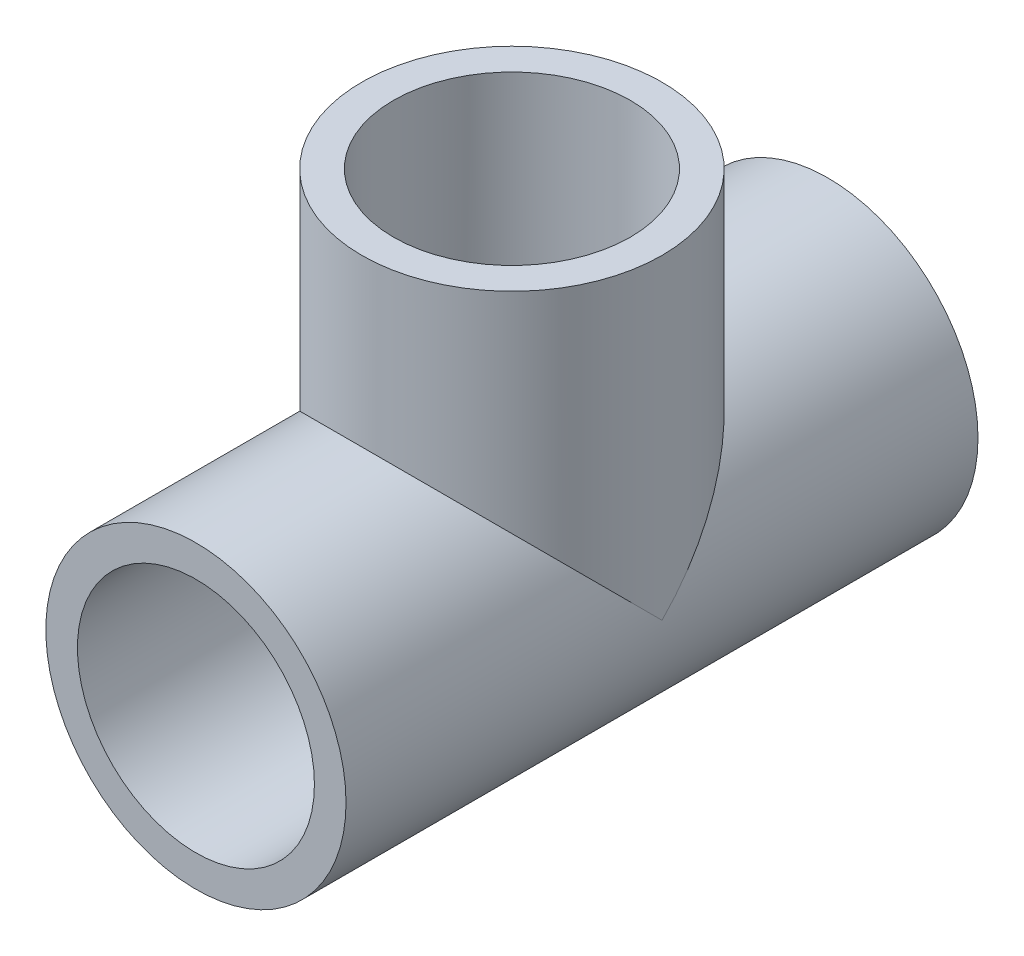
ISO-10303-21;
HEADER;
FILE_DESCRIPTION(('STEP AP214'),'2;1');
FILE_NAME('part.step','',(''),(''),'','','');
FILE_SCHEMA(('AUTOMOTIVE_DESIGN { 1 0 10303 214 1 1 1 1 }'));
ENDSEC;
DATA;
#1=APPLICATION_CONTEXT('core data for automotive mechanical design processes');
#2=APPLICATION_PROTOCOL_DEFINITION('international standard','automotive_design',2000,#1);
#3=PRODUCT_CONTEXT('',#1,'mechanical');
#4=PRODUCT('Part','Part','',(#3));
#5=PRODUCT_RELATED_PRODUCT_CATEGORY('part','',(#4));
#6=PRODUCT_DEFINITION_FORMATION('','',#4);
#7=PRODUCT_DEFINITION_CONTEXT('part definition',#1,'design');
#8=PRODUCT_DEFINITION('design','',#6,#7);
#9=PRODUCT_DEFINITION_SHAPE('','',#8);
#10=(LENGTH_UNIT() NAMED_UNIT(*) SI_UNIT(.MILLI.,.METRE.));
#11=(NAMED_UNIT(*) PLANE_ANGLE_UNIT() SI_UNIT($,.RADIAN.));
#12=(NAMED_UNIT(*) SI_UNIT($,.STERADIAN.) SOLID_ANGLE_UNIT());
#13=UNCERTAINTY_MEASURE_WITH_UNIT(LENGTH_MEASURE(1.E-05),#10,'distance_accuracy_value','');
#14=(GEOMETRIC_REPRESENTATION_CONTEXT(3) GLOBAL_UNCERTAINTY_ASSIGNED_CONTEXT((#13)) GLOBAL_UNIT_ASSIGNED_CONTEXT((#10,
#11,#12)) REPRESENTATION_CONTEXT('',''));
#15=CARTESIAN_POINT('',(0.,0.,0.));
#16=DIRECTION('',(0.,0.,1.));
#17=DIRECTION('',(1.,0.,0.));
#18=AXIS2_PLACEMENT_3D('',#15,#16,#17);
#19=CARTESIAN_POINT('',(0.,0.,101.6));
#20=DIRECTION('',(0.,0.,-1.));
#21=DIRECTION('',(-1.,0.,0.));
#22=AXIS2_PLACEMENT_3D('',#19,#20,#21);
#23=CYLINDRICAL_SURFACE('',#22,24.13);
#24=CARTESIAN_POINT('',(0.,0.,0.));
#25=DIRECTION('',(0.,0.,1.));
#26=DIRECTION('',(1.,0.,0.));
#27=AXIS2_PLACEMENT_3D('',#24,#25,#26);
#28=CIRCLE('',#27,24.13);
#29=CARTESIAN_POINT('',(24.13,0.,0.));
#30=VERTEX_POINT('',#29);
#31=EDGE_CURVE('E38',#30,#30,#28,.T.);
#32=ORIENTED_EDGE('',*,*,#31,.T.);
#33=EDGE_LOOP('',(#32));
#34=FACE_BOUND('',#33,.T.);
#35=CARTESIAN_POINT('',(0.,0.,101.6));
#36=DIRECTION('',(0.,0.,1.));
#37=DIRECTION('',(1.,0.,0.));
#38=AXIS2_PLACEMENT_3D('',#35,#36,#37);
#39=CIRCLE('',#38,24.13);
#40=CARTESIAN_POINT('',(24.13,0.,101.6));
#41=VERTEX_POINT('',#40);
#42=EDGE_CURVE('E11',#41,#41,#39,.T.);
#43=ORIENTED_EDGE('',*,*,#42,.F.);
#44=EDGE_LOOP('',(#43));
#45=FACE_BOUND('',#44,.T.);
#46=CARTESIAN_POINT('',(0.,0.,50.8));
#47=DIRECTION('',(0.,-0.707106781186547,-0.707106781186547));
#48=DIRECTION('',(0.,0.707106781186547,-0.707106781186547));
#49=AXIS2_PLACEMENT_3D('',#46,#47,#48);
#50=ELLIPSE('',#49,34.1249732600628,24.13);
#51=CARTESIAN_POINT('',(24.13,0.,50.8));
#52=VERTEX_POINT('',#51);
#53=CARTESIAN_POINT('',(-24.13,0.,50.8));
#54=VERTEX_POINT('',#53);
#55=EDGE_CURVE('E50',#52,#54,#50,.F.);
#56=ORIENTED_EDGE('',*,*,#55,.F.);
#57=CARTESIAN_POINT('',(0.,0.,50.8));
#58=DIRECTION('',(0.,0.707106781186547,-0.707106781186547));
#59=DIRECTION('',(0.,-0.707106781186547,-0.707106781186547));
#60=AXIS2_PLACEMENT_3D('',#57,#58,#59);
#61=ELLIPSE('',#60,34.1249732600628,24.13);
#62=EDGE_CURVE('E48',#54,#52,#61,.T.);
#63=ORIENTED_EDGE('',*,*,#62,.F.);
#64=EDGE_LOOP('',(#56,#63));
#65=FACE_BOUND('',#64,.T.);
#66=ADVANCED_FACE('F33',(#34,#45,#65),#23,.T.);
#67=CARTESIAN_POINT('',(0.,0.,101.6));
#68=DIRECTION('',(0.,0.,1.));
#69=DIRECTION('',(1.,0.,0.));
#70=AXIS2_PLACEMENT_3D('',#67,#68,#69);
#71=PLANE('',#70);
#72=ORIENTED_EDGE('',*,*,#42,.T.);
#73=EDGE_LOOP('',(#72));
#74=FACE_BOUND('',#73,.T.);
#75=CARTESIAN_POINT('',(0.,0.,101.6));
#76=DIRECTION('',(0.,0.,1.));
#77=DIRECTION('',(1.,0.,0.));
#78=AXIS2_PLACEMENT_3D('',#75,#76,#77);
#79=CIRCLE('',#78,19.05);
#80=CARTESIAN_POINT('',(19.05,0.,101.6));
#81=VERTEX_POINT('',#80);
#82=EDGE_CURVE('E66',#81,#81,#79,.T.);
#83=ORIENTED_EDGE('',*,*,#82,.F.);
#84=EDGE_LOOP('',(#83));
#85=FACE_BOUND('',#84,.T.);
#86=ADVANCED_FACE('F86',(#74,#85),#71,.T.);
#87=CARTESIAN_POINT('',(0.,0.,0.));
#88=DIRECTION('',(0.,0.,1.));
#89=DIRECTION('',(1.,0.,0.));
#90=AXIS2_PLACEMENT_3D('',#87,#88,#89);
#91=PLANE('',#90);
#92=ORIENTED_EDGE('',*,*,#31,.F.);
#93=EDGE_LOOP('',(#92));
#94=FACE_BOUND('',#93,.T.);
#95=CARTESIAN_POINT('',(0.,0.,0.));
#96=DIRECTION('',(0.,0.,1.));
#97=DIRECTION('',(1.,0.,0.));
#98=AXIS2_PLACEMENT_3D('',#95,#96,#97);
#99=CIRCLE('',#98,19.05);
#100=CARTESIAN_POINT('',(19.05,0.,0.));
#101=VERTEX_POINT('',#100);
#102=EDGE_CURVE('E52',#101,#101,#99,.T.);
#103=ORIENTED_EDGE('',*,*,#102,.T.);
#104=EDGE_LOOP('',(#103));
#105=FACE_BOUND('',#104,.T.);
#106=ADVANCED_FACE('F72',(#94,#105),#91,.F.);
#107=CARTESIAN_POINT('',(0.,50.8,50.8));
#108=DIRECTION('',(0.,-1.,0.));
#109=DIRECTION('',(0.,0.,-1.));
#110=AXIS2_PLACEMENT_3D('',#107,#108,#109);
#111=CYLINDRICAL_SURFACE('',#110,24.13);
#112=CARTESIAN_POINT('',(0.,50.8,50.8));
#113=DIRECTION('',(0.,1.,0.));
#114=DIRECTION('',(0.,0.,1.));
#115=AXIS2_PLACEMENT_3D('',#112,#113,#114);
#116=CIRCLE('',#115,24.13);
#117=CARTESIAN_POINT('',(0.,50.8,74.93));
#118=VERTEX_POINT('',#117);
#119=EDGE_CURVE('E58',#118,#118,#116,.T.);
#120=ORIENTED_EDGE('',*,*,#119,.F.);
#121=EDGE_LOOP('',(#120));
#122=FACE_BOUND('',#121,.T.);
#123=ORIENTED_EDGE('',*,*,#62,.T.);
#124=ORIENTED_EDGE('',*,*,#55,.T.);
#125=EDGE_LOOP('',(#123,#124));
#126=FACE_BOUND('',#125,.T.);
#127=ADVANCED_FACE('F54',(#122,#126),#111,.T.);
#128=CARTESIAN_POINT('',(0.,50.8,50.8));
#129=DIRECTION('',(0.,-1.,0.));
#130=DIRECTION('',(0.,0.,-1.));
#131=AXIS2_PLACEMENT_3D('',#128,#129,#130);
#132=CYLINDRICAL_SURFACE('',#131,19.05);
#133=CARTESIAN_POINT('',(0.,50.8,50.8));
#134=DIRECTION('',(0.,1.,0.));
#135=DIRECTION('',(0.,0.,1.));
#136=AXIS2_PLACEMENT_3D('',#133,#134,#135);
#137=CIRCLE('',#136,19.05);
#138=CARTESIAN_POINT('',(0.,50.8,69.85));
#139=VERTEX_POINT('',#138);
#140=EDGE_CURVE('E120',#139,#139,#137,.T.);
#141=ORIENTED_EDGE('',*,*,#140,.T.);
#142=EDGE_LOOP('',(#141));
#143=FACE_BOUND('',#142,.T.);
#144=CARTESIAN_POINT('',(0.,24.13,31.75));
#145=CARTESIAN_POINT('',(-0.459193743991274,24.1299980705752,31.750001982373));
#146=CARTESIAN_POINT('',(-0.91841827425051,24.1168641796842,31.7666303927591));
#147=CARTESIAN_POINT('',(-1.83317872694672,24.0646293010724,31.8328602155218));
#148=CARTESIAN_POINT('',(-2.28871284475151,24.0255163037282,31.8824768777205));
#149=CARTESIAN_POINT('',(-3.19298593981622,23.9221486973538,32.0139294068827));
#150=CARTESIAN_POINT('',(-3.64171217824956,23.857851848816,32.0958194055992));
#151=CARTESIAN_POINT('',(-4.52823731856037,23.7055744913334,32.2904475753186));
#152=CARTESIAN_POINT('',(-4.96603724907517,23.6175962210934,32.4031828304059));
#153=CARTESIAN_POINT('',(-5.82526699058039,23.4204241460184,32.6570065468254));
#154=CARTESIAN_POINT('',(-6.24678212732092,23.3113666086025,32.7979130852381));
#155=CARTESIAN_POINT('',(-7.07411735106319,23.0737736529889,33.1066581165607));
#156=CARTESIAN_POINT('',(-7.47993740495128,22.9452381936994,33.2744966662882));
#157=CARTESIAN_POINT('',(-8.27413959582549,22.6709503572605,33.6351724349353));
#158=CARTESIAN_POINT('',(-8.66252484364256,22.5252010685004,33.8280051701699));
#159=CARTESIAN_POINT('',(-9.42077506601121,22.2187579026194,34.2368749641564));
#160=CARTESIAN_POINT('',(-9.79063627927179,22.0580610091734,34.4529167076971));
#161=CARTESIAN_POINT('',(-10.6340276729216,21.6669779539872,34.9839953441611));
#162=CARTESIAN_POINT('',(-11.0998197462647,21.4315356268972,35.3076415198749));
#163=CARTESIAN_POINT('',(-11.9952921519236,20.9434971932403,35.9901175310988));
#164=CARTESIAN_POINT('',(-12.4249611436687,20.6908957443614,36.3489583396635));
#165=CARTESIAN_POINT('',(-13.2485490258758,20.1734955634586,37.1000047739043));
#166=CARTESIAN_POINT('',(-13.6423707324407,19.908666445722,37.4922958236089));
#167=CARTESIAN_POINT('',(-14.3925386055046,19.3732818057737,38.307435604055));
#168=CARTESIAN_POINT('',(-14.7488888553013,19.1027269113728,38.7302809967726));
#169=CARTESIAN_POINT('',(-15.42871636396,18.5581251985659,39.6119845778677));
#170=CARTESIAN_POINT('',(-15.7516293103672,18.2840859347049,40.0712829933498));
#171=CARTESIAN_POINT('',(-16.3576664990597,17.743968728289,41.0201060653237));
#172=CARTESIAN_POINT('',(-16.6407785813775,17.4778932382859,41.509639893879));
#173=CARTESIAN_POINT('',(-17.1648023167869,16.9635106567995,42.5178616113008));
#174=CARTESIAN_POINT('',(-17.4058314386136,16.7151552879779,43.0364628305709));
#175=CARTESIAN_POINT('',(-17.7341873405803,16.3640243811367,43.8369446169188));
#176=CARTESIAN_POINT('',(-17.8380820415995,16.2505783305104,44.1074514016658));
#177=CARTESIAN_POINT('',(-18.0344207479926,16.0324070271696,44.6561338490076));
#178=CARTESIAN_POINT('',(-18.1268626603008,15.9276833696675,44.9343109020664));
#179=CARTESIAN_POINT('',(-18.3142357498611,15.7120770713483,45.5454914720511));
#180=CARTESIAN_POINT('',(-18.4069761305896,15.6031153529456,45.8798546840972));
#181=CARTESIAN_POINT('',(-18.5749822028833,15.4027285771821,46.5580081275903));
#182=CARTESIAN_POINT('',(-18.6502543041167,15.3112970895687,46.9017948493136));
#183=CARTESIAN_POINT('',(-18.7821375740321,15.1492288119329,47.5970757387732));
#184=CARTESIAN_POINT('',(-18.8387852858783,15.0785513296852,47.9485533524871));
#185=CARTESIAN_POINT('',(-18.9325776346748,14.9606188178936,48.6580366778226));
#186=CARTESIAN_POINT('',(-18.9697224672153,14.9133635534533,49.0160423239386));
#187=CARTESIAN_POINT('',(-19.0239080802898,14.844184034629,49.7389540580238));
#188=CARTESIAN_POINT('',(-19.0407855947328,14.8224655237526,50.1038924403587));
#189=CARTESIAN_POINT('',(-19.0534736298126,14.8061526372857,50.8347346439271));
#190=CARTESIAN_POINT('',(-19.0492850019938,14.8115571653163,51.2006384255394));
#191=CARTESIAN_POINT('',(-19.0199360704617,14.8492251391196,51.9305072396267));
#192=CARTESIAN_POINT('',(-18.9947579477593,14.8815114060611,52.294470360277));
#193=CARTESIAN_POINT('',(-18.9240129195941,14.9713681195921,53.0172429813292));
#194=CARTESIAN_POINT('',(-18.8784431399472,15.0289421304433,53.3760517478693));
#195=CARTESIAN_POINT('',(-18.7582606090959,15.1787781335586,54.1478332663027));
#196=CARTESIAN_POINT('',(-18.6799801637121,15.2753259297998,54.5593999043518));
#197=CARTESIAN_POINT('',(-18.4984394078938,15.4946711150705,55.3697728172629));
#198=CARTESIAN_POINT('',(-18.3951734130294,15.6174744767289,55.768576164954));
#199=CARTESIAN_POINT('',(-18.1651443916058,15.8844423221382,56.5530451251513));
#200=CARTESIAN_POINT('',(-18.0383260957779,16.0286568876841,56.9386772557806));
#201=CARTESIAN_POINT('',(-17.7628537012281,16.3334061670568,57.695336905191));
#202=CARTESIAN_POINT('',(-17.6141979531345,16.4939421133469,58.0663633181232));
#203=CARTESIAN_POINT('',(-17.223225552876,16.9035509128813,58.9607944473645));
#204=CARTESIAN_POINT('',(-16.9692323010254,17.1594474619832,59.4759953991081));
#205=CARTESIAN_POINT('',(-16.4196901877294,17.6860322336473,60.4758397988936));
#206=CARTESIAN_POINT('',(-16.1241236086173,17.9567267325528,60.9604700901494));
#207=CARTESIAN_POINT('',(-15.4925330417186,18.5044117922617,61.8997515096336));
#208=CARTESIAN_POINT('',(-15.1564650739628,18.7814089274823,62.3543692034749));
#209=CARTESIAN_POINT('',(-14.4449435922821,19.3339974719406,63.2324314375797));
#210=CARTESIAN_POINT('',(-14.0694961405046,19.6095890907165,63.655880758928));
#211=CARTESIAN_POINT('',(-13.2711628675014,20.1586905885185,64.4789738228137));
#212=CARTESIAN_POINT('',(-12.8474366965483,20.4320309837525,64.8779180601021));
#213=CARTESIAN_POINT('',(-11.9597516833696,20.9639954527518,65.6394366718941));
#214=CARTESIAN_POINT('',(-11.495787097946,21.2226174170133,66.002005838631));
#215=CARTESIAN_POINT('',(-10.5295807298475,21.7181647695603,66.6864675115512));
#216=CARTESIAN_POINT('',(-10.0274315132564,21.9551397430983,67.0084536560984));
#217=CARTESIAN_POINT('',(-9.24656138832192,22.2898694756017,67.4581462557566));
#218=CARTESIAN_POINT('',(-8.98169917155982,22.3979781321201,67.6024797332553));
#219=CARTESIAN_POINT('',(-8.44294331135441,22.6065709083616,67.8795484578483));
#220=CARTESIAN_POINT('',(-8.16904751914622,22.7070531950046,68.0122809176678));
#221=CARTESIAN_POINT('',(-7.4973404447971,22.9394882198976,68.3179698005979));
#222=CARTESIAN_POINT('',(-7.09523493293755,23.0672162292489,68.4847870609419));
#223=CARTESIAN_POINT('',(-6.27568047388829,23.3035312436709,68.7919367404115));
#224=CARTESIAN_POINT('',(-5.85823535708447,23.4121229884476,68.932275718338));
#225=CARTESIAN_POINT('',(-5.01022739238894,23.6081292185773,69.1846589504244));
#226=CARTESIAN_POINT('',(-4.57967144139151,23.6955546289099,69.2967178026105));
#227=CARTESIAN_POINT('',(-3.70787274492528,23.8475227994539,69.4910034418989));
#228=CARTESIAN_POINT('',(-3.26662969720766,23.9120649116784,69.5732293842238));
#229=CARTESIAN_POINT('',(-2.37451357509375,24.0171026867124,69.7068383803685));
#230=CARTESIAN_POINT('',(-1.92360521781241,24.0574849414386,69.7580759847889));
#231=CARTESIAN_POINT('',(-1.01771609698335,24.1127987293404,69.8282192928934));
#232=CARTESIAN_POINT('',(-0.562735342633185,24.1277303199819,69.8471250695806));
#233=CARTESIAN_POINT('',(0.347501418173413,24.1317897186413,69.8522669775123));
#234=CARTESIAN_POINT('',(0.802757409338719,24.1209188482155,69.8385047819524));
#235=CARTESIAN_POINT('',(1.70977236878492,24.0736326500114,69.7785597301204));
#236=CARTESIAN_POINT('',(2.16153147473684,24.0372183330934,69.7323781568179));
#237=CARTESIAN_POINT('',(3.02609965561185,23.9431640909401,69.6128136797952));
#238=CARTESIAN_POINT('',(3.4393963782235,23.8872152582853,69.541595523866));
#239=CARTESIAN_POINT('',(4.25726107476787,23.7550880451033,69.3728984972513));
#240=CARTESIAN_POINT('',(4.66182954448015,23.6789108168718,69.2754211223984));
#241=CARTESIAN_POINT('',(5.4600526699542,23.5076879211374,69.0554582635116));
#242=CARTESIAN_POINT('',(5.85370587939048,23.4126397666318,68.9329694831597));
#243=CARTESIAN_POINT('',(6.6281986162399,23.205271599771,68.6644201467217));
#244=CARTESIAN_POINT('',(7.00903741901151,23.0929506126487,68.5183582602988));
#245=CARTESIAN_POINT('',(7.78366637222588,22.8440098078766,68.1927053545699));
#246=CARTESIAN_POINT('',(8.17637675276817,22.706215527193,68.0114462972137));
#247=CARTESIAN_POINT('',(8.943962242321,22.4149723194969,67.6253572057074));
#248=CARTESIAN_POINT('',(9.31883667173514,22.2615227966779,67.4205262744222));
#249=CARTESIAN_POINT('',(10.0498629893426,21.9412041945866,66.9889765178553));
#250=CARTESIAN_POINT('',(10.4060108962926,21.7743322806484,66.7622530670695));
#251=CARTESIAN_POINT('',(11.0988912328535,21.4294497809503,66.2884891249098));
#252=CARTESIAN_POINT('',(11.4356210272254,21.2514376901564,66.0414458869167));
#253=CARTESIAN_POINT('',(12.152428771612,20.8512549673896,65.4787874643717));
#254=CARTESIAN_POINT('',(12.5283020654414,20.6272004548147,65.1591486811423));
#255=CARTESIAN_POINT('',(13.2513770184926,20.1702963598457,64.4946950189337));
#256=CARTESIAN_POINT('',(13.5985746601584,19.9374455516987,64.1498766249138));
#257=CARTESIAN_POINT('',(14.2644470096691,19.4666103773963,63.4359276517945));
#258=CARTESIAN_POINT('',(14.5830821628619,19.2286194417652,63.0667645497032));
#259=CARTESIAN_POINT('',(15.1909774772073,18.7520726604535,62.305390854258));
#260=CARTESIAN_POINT('',(15.4802394243997,18.5135168500238,61.9131816645151));
#261=CARTESIAN_POINT('',(16.0275089376163,18.0417754751295,61.1081114642084));
#262=CARTESIAN_POINT('',(16.2856703619151,17.808568522337,60.6953677110549));
#263=CARTESIAN_POINT('',(16.7716842317943,17.3516207167966,59.8472115031038));
#264=CARTESIAN_POINT('',(16.9995313902911,17.1278815199399,59.4117951123691));
#265=CARTESIAN_POINT('',(17.4231566919935,16.6967566225694,58.5188063988205));
#266=CARTESIAN_POINT('',(17.6189861056335,16.4893450581796,58.0612710485889));
#267=CARTESIAN_POINT('',(17.976896558808,16.0983940075094,57.123394482701));
#268=CARTESIAN_POINT('',(18.1389951810381,15.9148421028361,56.643065309847));
#269=CARTESIAN_POINT('',(18.3795206612245,15.6356053698071,55.8213772498238));
#270=CARTESIAN_POINT('',(18.4679643794453,15.5308305189479,55.4860204042152));
#271=CARTESIAN_POINT('',(18.6272725469254,15.3393978150326,54.8061253274923));
#272=CARTESIAN_POINT('',(18.6981427922034,15.2527339901506,54.4615901651661));
#273=CARTESIAN_POINT('',(18.8211262609912,15.1007180310315,53.7652077252681));
#274=CARTESIAN_POINT('',(18.8732748072315,15.0353257852726,53.4133755566191));
#275=CARTESIAN_POINT('',(18.9580047402279,14.9283503551613,52.703735002641));
#276=CARTESIAN_POINT('',(18.990586517989,14.8867666950397,52.3459267368798));
#277=CARTESIAN_POINT('',(19.0356097951698,14.8291548693545,51.6243897180741));
#278=CARTESIAN_POINT('',(19.0479062953545,14.8133107019191,51.260636952091));
#279=CARTESIAN_POINT('',(19.051602357906,14.8085569026072,50.5328582161325));
#280=CARTESIAN_POINT('',(19.0430025109826,14.8196465093514,50.1688322541708));
#281=CARTESIAN_POINT('',(19.0051033078248,14.8682170642276,49.4432935658733));
#282=CARTESIAN_POINT('',(18.9757834831962,14.9057241089128,49.0817836819694));
#283=CARTESIAN_POINT('',(18.8971061443695,15.0053412566557,48.3643950314516));
#284=CARTESIAN_POINT('',(18.8477456955791,15.0674549628882,48.0085170974694));
#285=CARTESIAN_POINT('',(18.7181214001388,15.228313428158,47.2337499298475));
#286=CARTESIAN_POINT('',(18.6336397405111,15.3319120384309,46.8165764459285));
#287=CARTESIAN_POINT('',(18.4390968863172,15.5653337768786,45.995807319797));
#288=CARTESIAN_POINT('',(18.3290291627862,15.6951635975361,45.592215173367));
#289=CARTESIAN_POINT('',(18.0848394196003,15.9759237673667,44.7988519630812));
#290=CARTESIAN_POINT('',(17.9506608470436,16.1269035369706,44.4091160307726));
#291=CARTESIAN_POINT('',(17.6599397689898,16.4447516832593,43.6448467711852));
#292=CARTESIAN_POINT('',(17.5033958117503,16.6116210911097,43.2703144328035));
#293=CARTESIAN_POINT('',(17.0941625102112,17.0342999922506,42.3718755190695));
#294=CARTESIAN_POINT('',(16.8298229476627,17.296457908773,41.856235953026));
#295=CARTESIAN_POINT('',(16.2589638027638,17.834152555124,40.8561439888376));
#296=CARTESIAN_POINT('',(15.9524269448058,18.1096947344273,40.3717044838729));
#297=CARTESIAN_POINT('',(15.2981823119006,18.6656641534468,39.4335846608653));
#298=CARTESIAN_POINT('',(14.9504336317171,18.946096007047,38.979935618411));
#299=CARTESIAN_POINT('',(14.2147564573779,19.5041222899358,38.1047286284036));
#300=CARTESIAN_POINT('',(13.8268341226627,19.7817171470445,37.6831657785277));
#301=CARTESIAN_POINT('',(13.004178429655,20.332176168195,36.8667536121984));
#302=CARTESIAN_POINT('',(12.5687561312939,20.6048774570793,36.4724867038158));
#303=CARTESIAN_POINT('',(11.6572024110723,21.1339597658216,35.7215116522691));
#304=CARTESIAN_POINT('',(11.1810647543984,21.3903382756198,35.3648092801575));
#305=CARTESIAN_POINT('',(10.1903251274044,21.8796431877183,34.6935722404062));
#306=CARTESIAN_POINT('',(9.67580880385544,22.1126192391753,34.3789478115375));
#307=CARTESIAN_POINT('',(8.60963626544751,22.5491104526096,33.7957249788161));
#308=CARTESIAN_POINT('',(8.05800018032506,22.7526413967643,33.5271019045718));
#309=CARTESIAN_POINT('',(7.09408682184066,23.0673838399714,33.1149312380533));
#310=CARTESIAN_POINT('',(6.69041782019475,23.1878520005499,32.9581844720444));
#311=CARTESIAN_POINT('',(5.86852517316772,23.4093641277418,32.6712310052651));
#312=CARTESIAN_POINT('',(5.45030255466592,23.5104094615291,32.5410224364306));
#313=CARTESIAN_POINT('',(4.60245664193939,23.6909637530792,32.3091199668402));
#314=CARTESIAN_POINT('',(4.17285953050489,23.770518127959,32.2073659165192));
#315=CARTESIAN_POINT('',(3.30427355142566,23.9067309638109,32.0335323684696));
#316=CARTESIAN_POINT('',(2.8652885542022,23.9633986758947,31.9614408804934));
#317=CARTESIAN_POINT('',(2.02283304995485,24.0484293419894,31.8534027419237));
#318=CARTESIAN_POINT('',(1.61993575178539,24.0789643983074,31.8146798993104));
#319=CARTESIAN_POINT('',(0.811367415895121,24.1197530630828,31.7629745007581));
#320=CARTESIAN_POINT('',(0.405695723285308,24.1300017046386,31.7499982485819));
#321=CARTESIAN_POINT('',(0.,24.13,31.75));
#322=B_SPLINE_CURVE_WITH_KNOTS('',3,(#144,#145,#146,#147,#148,#149,#150,#151,#152,#153,#154,
#155,#156,#157,#158,#159,#160,#161,#162,#163,#164,#165,#166,#167,#168,#169,#170,#171,#172,#173,
#174,#175,#176,#177,#178,#179,#180,#181,#182,#183,#184,#185,#186,#187,#188,#189,#190,#191,#192,
#193,#194,#195,#196,#197,#198,#199,#200,#201,#202,#203,#204,#205,#206,#207,#208,#209,#210,#211,
#212,#213,#214,#215,#216,#217,#218,#219,#220,#221,#222,#223,#224,#225,#226,#227,#228,#229,#230,
#231,#232,#233,#234,#235,#236,#237,#238,#239,#240,#241,#242,#243,#244,#245,#246,#247,#248,#249,
#250,#251,#252,#253,#254,#255,#256,#257,#258,#259,#260,#261,#262,#263,#264,#265,#266,#267,#268,
#269,#270,#271,#272,#273,#274,#275,#276,#277,#278,#279,#280,#281,#282,#283,#284,#285,#286,#287,
#288,#289,#290,#291,#292,#293,#294,#295,#296,#297,#298,#299,#300,#301,#302,#303,#304,#305,#306,
#307,#308,#309,#310,#311,#312,#313,#314,#315,#316,#317,#318,#319,#320,#321),.UNSPECIFIED.,.T.,
.F.,(4,2,2,2,2,2,2,2,2,2,2,2,2,2,2,2,2,2,2,2,2,2,2,2,2,2,2,2,2,2,2,2,2,2,2,2,2,2,2,2,2,2,2,2,2,
2,2,2,2,2,2,2,2,2,2,2,2,2,2,2,2,2,2,2,2,2,2,2,2,2,2,2,2,2,2,2,2,2,2,2,2,2,2,2,2,2,2,2,4),(0.,
1.37715092567578,2.75493892428915,4.135047776341,5.51502620667164,6.88636532181832,
8.25770733007325,9.6288036740806,11.0001772987445,12.8399395734459,14.6802772875376,
16.5254642475363,18.3704499270575,20.2427302288169,22.1155813126211,23.9831179753519,
24.9163313880035,25.8497151001962,26.9399044175369,28.0296930749551,29.1173305017675,
30.2049570206779,31.301287515631,32.3975736946055,33.4947915124106,34.5921640307295,
35.8799714543797,37.1680721413785,38.4592346599824,39.7504947496284,41.6342867018839,
43.5188839324769,45.4055463828525,47.2919188221568,49.2184859463183,51.1453285018993,
53.0676404806841,54.0285513995758,54.9896925570734,56.3493258110676,57.708621833778,
59.0672147544568,60.4258461433656,61.7908060016661,63.1557627779707,64.520649645115,
65.8854825010546,67.1533858646715,68.4212170185961,69.6892153712533,70.9572853078199,
72.3177972331192,73.6783609560357,75.0392127737457,76.400248840612,78.0244042579888,
79.6487868403882,81.2753852686042,82.9018847320854,84.5199749183946,86.1383469454371,
87.7541015181142,89.3690117322091,90.4550709931599,91.5407715761384,92.6244128379405,
93.7080324444923,94.7993647267394,95.890666158947,96.9830471516314,98.0755881617691,
99.3877735334494,100.70029411241,102.015934426543,103.331660178028,105.236947838472,
107.143017858025,109.0509958677,110.958681777318,112.899097465905,114.83981082766,
116.776315852043,118.711779059771,120.058927113605,121.405980306849,122.750164080927,
124.093803971867,125.310213180573,126.526920176641),.UNSPECIFIED.);
#323=CARTESIAN_POINT('',(0.,24.13,31.75));
#324=VERTEX_POINT('',#323);
#325=EDGE_CURVE('E55',#324,#324,#322,.T.);
#326=ORIENTED_EDGE('',*,*,#325,.F.);
#327=EDGE_LOOP('',(#326));
#328=FACE_BOUND('',#327,.T.);
#329=ADVANCED_FACE('F103',(#143,#328),#132,.F.);
#330=CARTESIAN_POINT('',(0.,50.8,50.8));
#331=DIRECTION('',(0.,1.,0.));
#332=DIRECTION('',(0.,0.,1.));
#333=AXIS2_PLACEMENT_3D('',#330,#331,#332);
#334=PLANE('',#333);
#335=ORIENTED_EDGE('',*,*,#119,.T.);
#336=EDGE_LOOP('',(#335));
#337=FACE_BOUND('',#336,.T.);
#338=ORIENTED_EDGE('',*,*,#140,.F.);
#339=EDGE_LOOP('',(#338));
#340=FACE_BOUND('',#339,.T.);
#341=ADVANCED_FACE('F81',(#337,#340),#334,.T.);
#342=ORIENTED_EDGE('',*,*,#325,.T.);
#343=EDGE_LOOP('',(#342));
#344=FACE_BOUND('',#343,.T.);
#345=ADVANCED_FACE('F35',(#344),#23,.T.);
#346=CARTESIAN_POINT('',(0.,0.,101.6));
#347=DIRECTION('',(0.,0.,-1.));
#348=DIRECTION('',(-1.,0.,0.));
#349=AXIS2_PLACEMENT_3D('',#346,#347,#348);
#350=CYLINDRICAL_SURFACE('',#349,19.05);
#351=ORIENTED_EDGE('',*,*,#82,.T.);
#352=EDGE_LOOP('',(#351));
#353=FACE_BOUND('',#352,.T.);
#354=ORIENTED_EDGE('',*,*,#102,.F.);
#355=EDGE_LOOP('',(#354));
#356=FACE_BOUND('',#355,.T.);
#357=ADVANCED_FACE('F74',(#353,#356),#350,.F.);
#358=CLOSED_SHELL('',(#66,#86,#106,#127,#329,#341,#345,#357));
#359=MANIFOLD_SOLID_BREP('B2',#358);
#360=ADVANCED_BREP_SHAPE_REPRESENTATION('',(#18,#359),#14);
#361=SHAPE_DEFINITION_REPRESENTATION(#9,#360);
ENDSEC;
END-ISO-10303-21;
